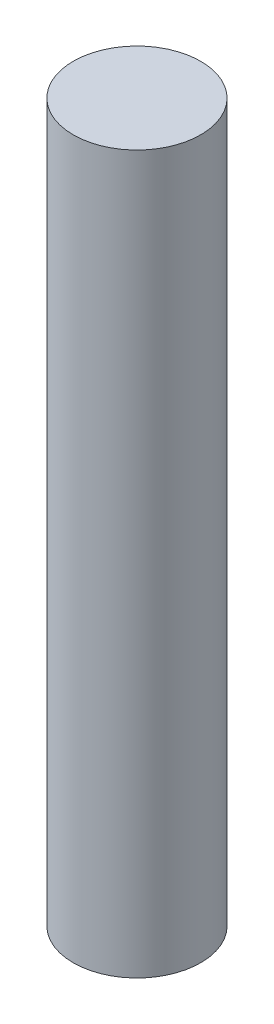
ISO-10303-21;
HEADER;
FILE_DESCRIPTION(('STEP AP214'),'2;1');
FILE_NAME('part.step','',(''),(''),'','','');
FILE_SCHEMA(('AUTOMOTIVE_DESIGN { 1 0 10303 214 1 1 1 1 }'));
ENDSEC;
DATA;
#1=APPLICATION_CONTEXT('core data for automotive mechanical design processes');
#2=APPLICATION_PROTOCOL_DEFINITION('international standard','automotive_design',2000,#1);
#3=PRODUCT_CONTEXT('',#1,'mechanical');
#4=PRODUCT('Part','Part','',(#3));
#5=PRODUCT_RELATED_PRODUCT_CATEGORY('part','',(#4));
#6=PRODUCT_DEFINITION_FORMATION('','',#4);
#7=PRODUCT_DEFINITION_CONTEXT('part definition',#1,'design');
#8=PRODUCT_DEFINITION('design','',#6,#7);
#9=PRODUCT_DEFINITION_SHAPE('','',#8);
#10=(LENGTH_UNIT() NAMED_UNIT(*) SI_UNIT(.MILLI.,.METRE.));
#11=(NAMED_UNIT(*) PLANE_ANGLE_UNIT() SI_UNIT($,.RADIAN.));
#12=(NAMED_UNIT(*) SI_UNIT($,.STERADIAN.) SOLID_ANGLE_UNIT());
#13=UNCERTAINTY_MEASURE_WITH_UNIT(LENGTH_MEASURE(1.E-05),#10,'distance_accuracy_value','');
#14=(GEOMETRIC_REPRESENTATION_CONTEXT(3) GLOBAL_UNCERTAINTY_ASSIGNED_CONTEXT((#13)) GLOBAL_UNIT_ASSIGNED_CONTEXT((#10,
#11,#12)) REPRESENTATION_CONTEXT('',''));
#15=CARTESIAN_POINT('',(0.,0.,0.));
#16=DIRECTION('',(0.,0.,1.));
#17=DIRECTION('',(1.,0.,0.));
#18=AXIS2_PLACEMENT_3D('',#15,#16,#17);
#19=CARTESIAN_POINT('',(60.,-45.,0.));
#20=DIRECTION('',(0.,1.,0.));
#21=DIRECTION('',(0.,0.,1.));
#22=AXIS2_PLACEMENT_3D('',#19,#20,#21);
#23=CYLINDRICAL_SURFACE('',#22,4.);
#24=CARTESIAN_POINT('',(60.,-45.,0.));
#25=DIRECTION('',(0.,1.,0.));
#26=DIRECTION('',(0.,0.,1.));
#27=AXIS2_PLACEMENT_3D('',#24,#25,#26);
#28=CIRCLE('',#27,4.);
#29=CARTESIAN_POINT('',(60.,-45.,4.));
#30=VERTEX_POINT('',#29);
#31=EDGE_CURVE('E10',#30,#30,#28,.T.);
#32=ORIENTED_EDGE('',*,*,#31,.T.);
#33=EDGE_LOOP('',(#32));
#34=FACE_BOUND('',#33,.T.);
#35=CARTESIAN_POINT('',(60.,0.,0.));
#36=DIRECTION('',(0.,1.,0.));
#37=DIRECTION('',(0.,0.,1.));
#38=AXIS2_PLACEMENT_3D('',#35,#36,#37);
#39=CIRCLE('',#38,4.);
#40=CARTESIAN_POINT('',(60.,0.,4.));
#41=VERTEX_POINT('',#40);
#42=EDGE_CURVE('E37',#41,#41,#39,.T.);
#43=ORIENTED_EDGE('',*,*,#42,.F.);
#44=EDGE_LOOP('',(#43));
#45=FACE_BOUND('',#44,.T.);
#46=ADVANCED_FACE('F31',(#34,#45),#23,.T.);
#47=CARTESIAN_POINT('',(64.,-45.,0.));
#48=DIRECTION('',(0.,-1.,0.));
#49=DIRECTION('',(0.,0.,-1.));
#50=AXIS2_PLACEMENT_3D('',#47,#48,#49);
#51=PLANE('',#50);
#52=ORIENTED_EDGE('',*,*,#31,.F.);
#53=EDGE_LOOP('',(#52));
#54=FACE_BOUND('',#53,.T.);
#55=ADVANCED_FACE('F46',(#54),#51,.T.);
#56=CARTESIAN_POINT('',(60.,0.,0.));
#57=DIRECTION('',(0.,1.,0.));
#58=DIRECTION('',(0.,0.,1.));
#59=AXIS2_PLACEMENT_3D('',#56,#57,#58);
#60=PLANE('',#59);
#61=ORIENTED_EDGE('',*,*,#42,.T.);
#62=EDGE_LOOP('',(#61));
#63=FACE_BOUND('',#62,.T.);
#64=ADVANCED_FACE('F43',(#63),#60,.T.);
#65=CLOSED_SHELL('',(#46,#55,#64));
#66=MANIFOLD_SOLID_BREP('B2',#65);
#67=ADVANCED_BREP_SHAPE_REPRESENTATION('',(#18,#66),#14);
#68=SHAPE_DEFINITION_REPRESENTATION(#9,#67);
ENDSEC;
END-ISO-10303-21;
